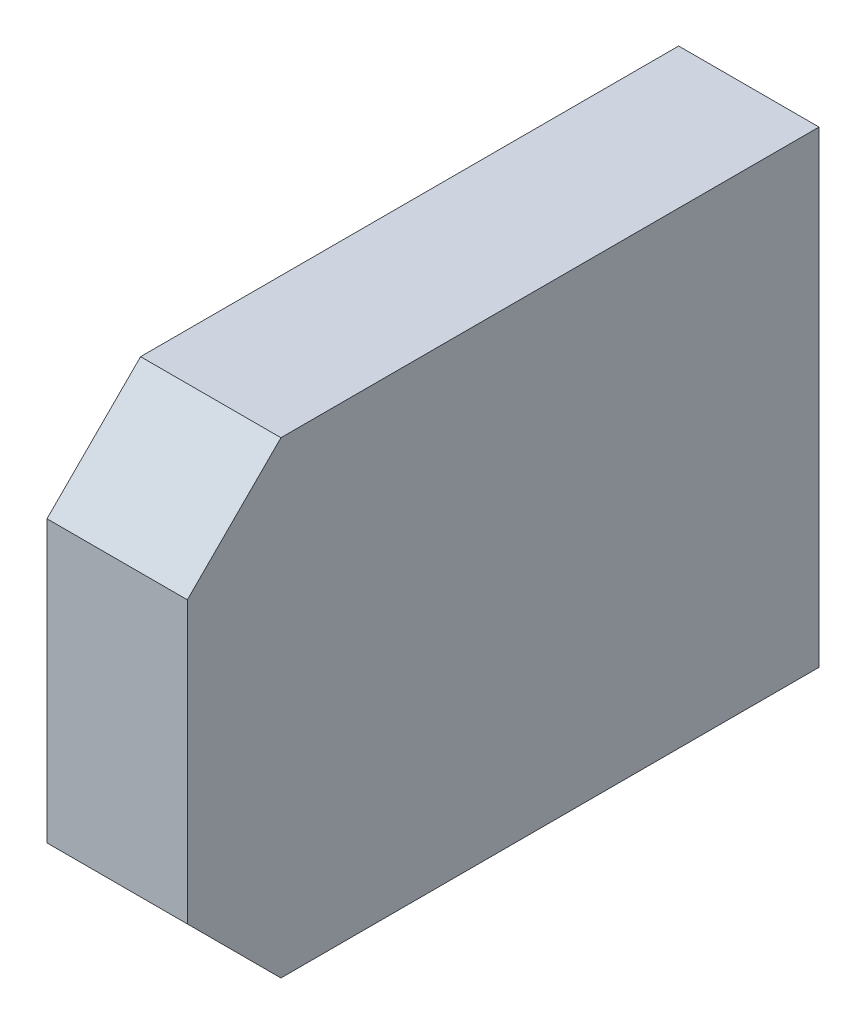
ISO-10303-21;
HEADER;
FILE_DESCRIPTION(('STEP AP214'),'2;1');
FILE_NAME('part.step','',(''),(''),'','','');
FILE_SCHEMA(('AUTOMOTIVE_DESIGN { 1 0 10303 214 1 1 1 1 }'));
ENDSEC;
DATA;
#1=APPLICATION_CONTEXT('core data for automotive mechanical design processes');
#2=APPLICATION_PROTOCOL_DEFINITION('international standard','automotive_design',2000,#1);
#3=PRODUCT_CONTEXT('',#1,'mechanical');
#4=PRODUCT('Part','Part','',(#3));
#5=PRODUCT_RELATED_PRODUCT_CATEGORY('part','',(#4));
#6=PRODUCT_DEFINITION_FORMATION('','',#4);
#7=PRODUCT_DEFINITION_CONTEXT('part definition',#1,'design');
#8=PRODUCT_DEFINITION('design','',#6,#7);
#9=PRODUCT_DEFINITION_SHAPE('','',#8);
#10=(LENGTH_UNIT() NAMED_UNIT(*) SI_UNIT(.MILLI.,.METRE.));
#11=(NAMED_UNIT(*) PLANE_ANGLE_UNIT() SI_UNIT($,.RADIAN.));
#12=(NAMED_UNIT(*) SI_UNIT($,.STERADIAN.) SOLID_ANGLE_UNIT());
#13=UNCERTAINTY_MEASURE_WITH_UNIT(LENGTH_MEASURE(1.E-05),#10,'distance_accuracy_value','');
#14=(GEOMETRIC_REPRESENTATION_CONTEXT(3) GLOBAL_UNCERTAINTY_ASSIGNED_CONTEXT((#13)) GLOBAL_UNIT_ASSIGNED_CONTEXT((#10,
#11,#12)) REPRESENTATION_CONTEXT('',''));
#15=CARTESIAN_POINT('',(0.,0.,0.));
#16=DIRECTION('',(0.,0.,1.));
#17=DIRECTION('',(1.,0.,0.));
#18=AXIS2_PLACEMENT_3D('',#15,#16,#17);
#19=CARTESIAN_POINT('',(44.47457889831,0.,0.));
#20=DIRECTION('',(1.,0.,0.));
#21=DIRECTION('',(0.,0.,-1.));
#22=AXIS2_PLACEMENT_3D('',#19,#20,#21);
#23=PLANE('',#22);
#24=DIRECTION('',(0.,1.,0.));
#25=VECTOR('',#24,1.);
#26=CARTESIAN_POINT('',(44.47457889831,-9.921262189784,1.670000000046));
#27=LINE('',#26,#25);
#28=CARTESIAN_POINT('',(44.47457889831,-10.92126218978,1.670000000046));
#29=VERTEX_POINT('',#28);
#30=CARTESIAN_POINT('',(44.47457889831,-9.921262189784,1.670000000046));
#31=VERTEX_POINT('',#30);
#32=EDGE_CURVE('E67',#29,#31,#27,.T.);
#33=ORIENTED_EDGE('',*,*,#32,.T.);
#34=DIRECTION('',(0.,0.,1.));
#35=VECTOR('',#34,1.);
#36=CARTESIAN_POINT('',(44.47457889831,-9.921262189784,4.079481005067));
#37=LINE('',#36,#35);
#38=CARTESIAN_POINT('',(44.47457889831,-9.9212621897835,2.8200000000465));
#39=VERTEX_POINT('',#38);
#40=EDGE_CURVE('E20',#39,#31,#37,.F.);
#41=ORIENTED_EDGE('',*,*,#40,.F.);
#42=DIRECTION('',(0.,-0.707106781186548,0.707106781186548));
#43=VECTOR('',#42,1.);
#44=CARTESIAN_POINT('',(44.47457889831,-10.12126218978,3.020000000046));
#45=LINE('',#44,#43);
#46=CARTESIAN_POINT('',(44.47457889831,-10.12126218978,3.020000000046));
#47=VERTEX_POINT('',#46);
#48=EDGE_CURVE('E103',#47,#39,#45,.F.);
#49=ORIENTED_EDGE('',*,*,#48,.F.);
#50=DIRECTION('',(0.,1.,0.));
#51=VECTOR('',#50,1.);
#52=CARTESIAN_POINT('',(44.47457889831,-9.871262189784,3.020000000046));
#53=LINE('',#52,#51);
#54=CARTESIAN_POINT('',(44.47457889831,-10.72126218978,3.020000000046));
#55=VERTEX_POINT('',#54);
#56=EDGE_CURVE('E98',#47,#55,#53,.F.);
#57=ORIENTED_EDGE('',*,*,#56,.T.);
#58=DIRECTION('',(0.,-0.707106781186548,-0.707106781186548));
#59=VECTOR('',#58,1.);
#60=CARTESIAN_POINT('',(44.47457889831,-10.72126218978,3.020000000046));
#61=LINE('',#60,#59);
#62=CARTESIAN_POINT('',(44.47457889831,-10.92126218978,2.820000000046));
#63=VERTEX_POINT('',#62);
#64=EDGE_CURVE('E95',#63,#55,#61,.F.);
#65=ORIENTED_EDGE('',*,*,#64,.F.);
#66=DIRECTION('',(0.,0.,-1.));
#67=VECTOR('',#66,1.);
#68=CARTESIAN_POINT('',(44.47457889831,-10.92126218978,4.079481005067));
#69=LINE('',#68,#67);
#70=EDGE_CURVE('E74',#29,#63,#69,.F.);
#71=ORIENTED_EDGE('',*,*,#70,.F.);
#72=EDGE_LOOP('',(#33,#41,#49,#57,#65,#71));
#73=FACE_BOUND('',#72,.T.);
#74=ADVANCED_FACE('F17',(#73),#23,.T.);
#75=CARTESIAN_POINT('',(44.52457889831,-9.921262189784,4.079481005067));
#76=DIRECTION('',(0.,1.,0.));
#77=DIRECTION('',(0.,0.,1.));
#78=AXIS2_PLACEMENT_3D('',#75,#76,#77);
#79=PLANE('',#78);
#80=ORIENTED_EDGE('',*,*,#40,.T.);
#81=DIRECTION('',(1.,0.,0.));
#82=VECTOR('',#81,1.);
#83=CARTESIAN_POINT('',(46.32735453604,-9.921262189784,1.670000000046));
#84=LINE('',#83,#82);
#85=CARTESIAN_POINT('',(44.17457889831,-9.921262189784,1.670000000046));
#86=VERTEX_POINT('',#85);
#87=EDGE_CURVE('E76',#31,#86,#84,.F.);
#88=ORIENTED_EDGE('',*,*,#87,.T.);
#89=DIRECTION('',(0.,0.,1.));
#90=VECTOR('',#89,1.);
#91=CARTESIAN_POINT('',(44.17457889831,-9.921262189784,4.079481005067));
#92=LINE('',#91,#90);
#93=CARTESIAN_POINT('',(44.17457889831,-9.9212621897835,2.8200000000465));
#94=VERTEX_POINT('',#93);
#95=EDGE_CURVE('E106',#94,#86,#92,.F.);
#96=ORIENTED_EDGE('',*,*,#95,.F.);
#97=DIRECTION('',(1.,0.,0.));
#98=VECTOR('',#97,1.);
#99=CARTESIAN_POINT('',(44.52457889831,-9.921262189782,2.820000000048));
#100=LINE('',#99,#98);
#101=EDGE_CURVE('E81',#39,#94,#100,.F.);
#102=ORIENTED_EDGE('',*,*,#101,.F.);
#103=EDGE_LOOP('',(#80,#88,#96,#102));
#104=FACE_BOUND('',#103,.T.);
#105=ADVANCED_FACE('F78',(#104),#79,.T.);
#106=CARTESIAN_POINT('',(46.32735453604,-9.921262189784,1.670000000046));
#107=DIRECTION('',(0.,0.,1.));
#108=DIRECTION('',(1.,0.,0.));
#109=AXIS2_PLACEMENT_3D('',#106,#107,#108);
#110=PLANE('',#109);
#111=ORIENTED_EDGE('',*,*,#87,.F.);
#112=ORIENTED_EDGE('',*,*,#32,.F.);
#113=DIRECTION('',(1.,0.,0.));
#114=VECTOR('',#113,1.);
#115=CARTESIAN_POINT('',(44.52457889831,-10.92126218978,1.670000000046));
#116=LINE('',#115,#114);
#117=CARTESIAN_POINT('',(44.17457889831,-10.92126218978,1.670000000046));
#118=VERTEX_POINT('',#117);
#119=EDGE_CURVE('E87',#118,#29,#116,.T.);
#120=ORIENTED_EDGE('',*,*,#119,.F.);
#121=DIRECTION('',(0.,1.,0.));
#122=VECTOR('',#121,1.);
#123=CARTESIAN_POINT('',(44.17457889831,-9.921262189784,1.670000000046));
#124=LINE('',#123,#122);
#125=EDGE_CURVE('E85',#86,#118,#124,.F.);
#126=ORIENTED_EDGE('',*,*,#125,.F.);
#127=EDGE_LOOP('',(#111,#112,#120,#126));
#128=FACE_BOUND('',#127,.T.);
#129=ADVANCED_FACE('F83',(#128),#110,.F.);
#130=CARTESIAN_POINT('',(44.52457889831,-10.92126218978,4.079481005067));
#131=DIRECTION('',(0.,-1.,0.));
#132=DIRECTION('',(0.,0.,-1.));
#133=AXIS2_PLACEMENT_3D('',#130,#131,#132);
#134=PLANE('',#133);
#135=ORIENTED_EDGE('',*,*,#70,.T.);
#136=DIRECTION('',(1.,0.,0.));
#137=VECTOR('',#136,1.);
#138=CARTESIAN_POINT('',(44.52457889831,-10.92126218978,2.820000000046));
#139=LINE('',#138,#137);
#140=CARTESIAN_POINT('',(44.17457889831,-10.92126218978,2.820000000046));
#141=VERTEX_POINT('',#140);
#142=EDGE_CURVE('E92',#141,#63,#139,.T.);
#143=ORIENTED_EDGE('',*,*,#142,.F.);
#144=DIRECTION('',(0.,0.,1.));
#145=VECTOR('',#144,1.);
#146=CARTESIAN_POINT('',(44.17457889831,-10.92126218978,4.079481005067));
#147=LINE('',#146,#145);
#148=EDGE_CURVE('E109',#118,#141,#147,.T.);
#149=ORIENTED_EDGE('',*,*,#148,.F.);
#150=ORIENTED_EDGE('',*,*,#119,.T.);
#151=EDGE_LOOP('',(#135,#143,#149,#150));
#152=FACE_BOUND('',#151,.T.);
#153=ADVANCED_FACE('F137',(#152),#134,.T.);
#154=CARTESIAN_POINT('',(44.52457889831,-10.72126218978,3.020000000046));
#155=DIRECTION('',(0.,-0.707106781186548,0.707106781186548));
#156=DIRECTION('',(0.,-0.707106781186548,-0.707106781186548));
#157=AXIS2_PLACEMENT_3D('',#154,#155,#156);
#158=PLANE('',#157);
#159=ORIENTED_EDGE('',*,*,#64,.T.);
#160=DIRECTION('',(-1.,0.,0.));
#161=VECTOR('',#160,1.);
#162=CARTESIAN_POINT('',(44.52457889831,-10.72126218978,3.020000000046));
#163=LINE('',#162,#161);
#164=CARTESIAN_POINT('',(44.17457889831,-10.72126218978,3.020000000046));
#165=VERTEX_POINT('',#164);
#166=EDGE_CURVE('E100',#55,#165,#163,.T.);
#167=ORIENTED_EDGE('',*,*,#166,.T.);
#168=DIRECTION('',(0.,0.707106781186548,0.707106781186547));
#169=VECTOR('',#168,1.);
#170=CARTESIAN_POINT('',(44.17457889831,-10.92126218978,2.820000000046));
#171=LINE('',#170,#169);
#172=EDGE_CURVE('E112',#141,#165,#171,.T.);
#173=ORIENTED_EDGE('',*,*,#172,.F.);
#174=ORIENTED_EDGE('',*,*,#142,.T.);
#175=EDGE_LOOP('',(#159,#167,#173,#174));
#176=FACE_BOUND('',#175,.T.);
#177=ADVANCED_FACE('F122',(#176),#158,.T.);
#178=CARTESIAN_POINT('',(44.52457889831,-9.871262189784,3.020000000046));
#179=DIRECTION('',(0.,0.,-1.));
#180=DIRECTION('',(-1.,0.,0.));
#181=AXIS2_PLACEMENT_3D('',#178,#179,#180);
#182=PLANE('',#181);
#183=ORIENTED_EDGE('',*,*,#166,.F.);
#184=ORIENTED_EDGE('',*,*,#56,.F.);
#185=DIRECTION('',(1.,0.,0.));
#186=VECTOR('',#185,1.);
#187=CARTESIAN_POINT('',(44.52457889831,-10.12126218978,3.020000000046));
#188=LINE('',#187,#186);
#189=CARTESIAN_POINT('',(44.17457889831,-10.12126218978,3.020000000046));
#190=VERTEX_POINT('',#189);
#191=EDGE_CURVE('E35',#190,#47,#188,.T.);
#192=ORIENTED_EDGE('',*,*,#191,.F.);
#193=DIRECTION('',(0.,1.,0.));
#194=VECTOR('',#193,1.);
#195=CARTESIAN_POINT('',(44.17457889831,-9.921262189784,3.020000000046));
#196=LINE('',#195,#194);
#197=EDGE_CURVE('E26',#165,#190,#196,.T.);
#198=ORIENTED_EDGE('',*,*,#197,.F.);
#199=EDGE_LOOP('',(#183,#184,#192,#198));
#200=FACE_BOUND('',#199,.T.);
#201=ADVANCED_FACE('F120',(#200),#182,.F.);
#202=CARTESIAN_POINT('',(44.52457889831,-10.12126218978,3.020000000046));
#203=DIRECTION('',(0.,0.707106781186548,0.707106781186548));
#204=DIRECTION('',(0.,-0.707106781186548,0.707106781186548));
#205=AXIS2_PLACEMENT_3D('',#202,#203,#204);
#206=PLANE('',#205);
#207=ORIENTED_EDGE('',*,*,#48,.T.);
#208=ORIENTED_EDGE('',*,*,#101,.T.);
#209=DIRECTION('',(0.,0.707106781179474,-0.707106781193621));
#210=VECTOR('',#209,1.);
#211=CARTESIAN_POINT('',(44.17457889831,-10.12126218978,3.020000000046));
#212=LINE('',#211,#210);
#213=EDGE_CURVE('E11',#190,#94,#212,.T.);
#214=ORIENTED_EDGE('',*,*,#213,.F.);
#215=ORIENTED_EDGE('',*,*,#191,.T.);
#216=EDGE_LOOP('',(#207,#208,#214,#215));
#217=FACE_BOUND('',#216,.T.);
#218=ADVANCED_FACE('F124',(#217),#206,.T.);
#219=CARTESIAN_POINT('',(44.17457889831,-9.921262189784,4.079481005067));
#220=DIRECTION('',(-1.,0.,0.));
#221=DIRECTION('',(0.,0.,1.));
#222=AXIS2_PLACEMENT_3D('',#219,#220,#221);
#223=PLANE('',#222);
#224=ORIENTED_EDGE('',*,*,#197,.T.);
#225=ORIENTED_EDGE('',*,*,#213,.T.);
#226=ORIENTED_EDGE('',*,*,#95,.T.);
#227=ORIENTED_EDGE('',*,*,#125,.T.);
#228=ORIENTED_EDGE('',*,*,#148,.T.);
#229=ORIENTED_EDGE('',*,*,#172,.T.);
#230=EDGE_LOOP('',(#224,#225,#226,#227,#228,#229));
#231=FACE_BOUND('',#230,.T.);
#232=ADVANCED_FACE('F117',(#231),#223,.T.);
#233=CLOSED_SHELL('',(#74,#105,#129,#153,#177,#201,#218,#232));
#234=MANIFOLD_SOLID_BREP('B1',#233);
#235=ADVANCED_BREP_SHAPE_REPRESENTATION('',(#18,#234),#14);
#236=SHAPE_DEFINITION_REPRESENTATION(#9,#235);
ENDSEC;
END-ISO-10303-21;
